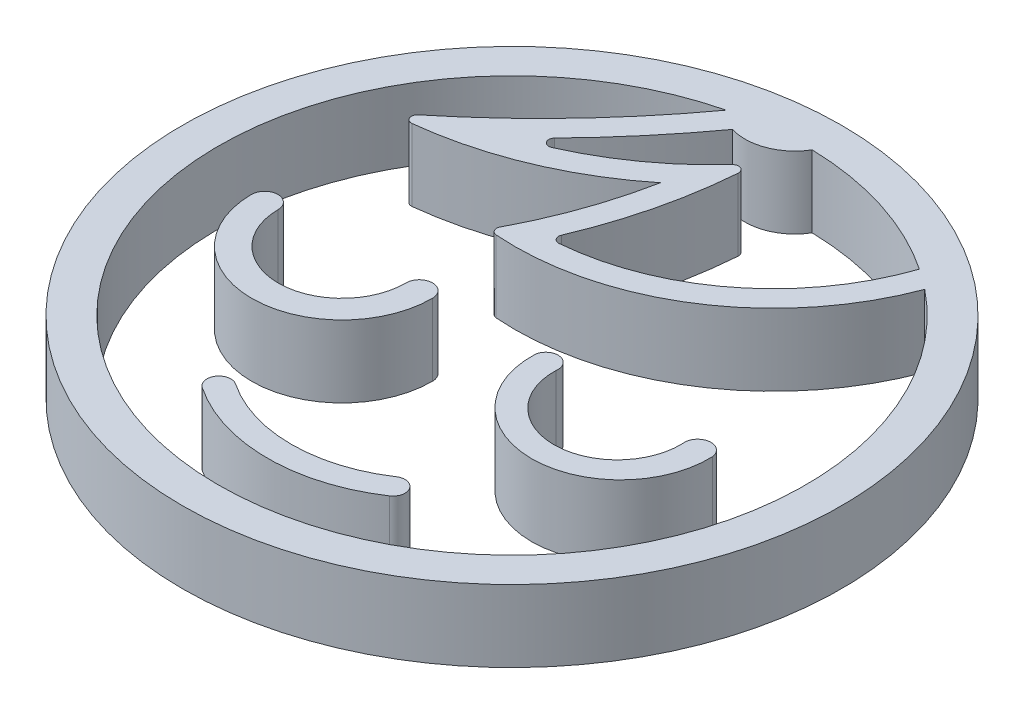
ISO-10303-21;
HEADER;
FILE_DESCRIPTION(('STEP AP214'),'2;1');
FILE_NAME('part.step','',(''),(''),'','','');
FILE_SCHEMA(('AUTOMOTIVE_DESIGN { 1 0 10303 214 1 1 1 1 }'));
ENDSEC;
DATA;
#1=APPLICATION_CONTEXT('core data for automotive mechanical design processes');
#2=APPLICATION_PROTOCOL_DEFINITION('international standard','automotive_design',2000,#1);
#3=PRODUCT_CONTEXT('',#1,'mechanical');
#4=PRODUCT('Part','Part','',(#3));
#5=PRODUCT_RELATED_PRODUCT_CATEGORY('part','',(#4));
#6=PRODUCT_DEFINITION_FORMATION('','',#4);
#7=PRODUCT_DEFINITION_CONTEXT('part definition',#1,'design');
#8=PRODUCT_DEFINITION('design','',#6,#7);
#9=PRODUCT_DEFINITION_SHAPE('','',#8);
#10=(LENGTH_UNIT() NAMED_UNIT(*) SI_UNIT(.MILLI.,.METRE.));
#11=(NAMED_UNIT(*) PLANE_ANGLE_UNIT() SI_UNIT($,.RADIAN.));
#12=(NAMED_UNIT(*) SI_UNIT($,.STERADIAN.) SOLID_ANGLE_UNIT());
#13=UNCERTAINTY_MEASURE_WITH_UNIT(LENGTH_MEASURE(1.E-05),#10,'distance_accuracy_value','');
#14=(GEOMETRIC_REPRESENTATION_CONTEXT(3) GLOBAL_UNCERTAINTY_ASSIGNED_CONTEXT((#13)) GLOBAL_UNIT_ASSIGNED_CONTEXT((#10,
#11,#12)) REPRESENTATION_CONTEXT('',''));
#15=CARTESIAN_POINT('',(0.,0.,0.));
#16=DIRECTION('',(0.,0.,1.));
#17=DIRECTION('',(1.,0.,0.));
#18=AXIS2_PLACEMENT_3D('',#15,#16,#17);
#19=CARTESIAN_POINT('',(-7.14874364678689,6.,17.3094622205207));
#20=DIRECTION('',(0.,-1.,0.));
#21=DIRECTION('',(0.,0.,-1.));
#22=AXIS2_PLACEMENT_3D('',#19,#20,#21);
#23=CYLINDRICAL_SURFACE('',#22,1.);
#24=CARTESIAN_POINT('',(-7.14874364678689,0.,17.3094622205207));
#25=DIRECTION('',(0.,1.,0.));
#26=DIRECTION('',(0.,0.,1.));
#27=AXIS2_PLACEMENT_3D('',#24,#25,#26);
#28=CIRCLE('',#27,1.);
#29=CARTESIAN_POINT('',(-6.59179802216933,0.,16.4789132627709));
#30=VERTEX_POINT('',#29);
#31=CARTESIAN_POINT('',(-7.70568927140446,0.,18.1400111782706));
#32=VERTEX_POINT('',#31);
#33=EDGE_CURVE('E13',#30,#32,#28,.T.);
#34=ORIENTED_EDGE('',*,*,#33,.T.);
#35=DIRECTION('',(0.,-1.,0.));
#36=VECTOR('',#35,1.);
#37=CARTESIAN_POINT('',(-7.70568927140446,6.,18.1400111782706));
#38=LINE('',#37,#36);
#39=CARTESIAN_POINT('',(-7.70568927140446,6.,18.1400111782706));
#40=VERTEX_POINT('',#39);
#41=EDGE_CURVE('E163',#40,#32,#38,.T.);
#42=ORIENTED_EDGE('',*,*,#41,.F.);
#43=CARTESIAN_POINT('',(-7.14874364678689,6.,17.3094622205207));
#44=DIRECTION('',(0.,1.,0.));
#45=DIRECTION('',(0.,0.,1.));
#46=AXIS2_PLACEMENT_3D('',#43,#44,#45);
#47=CIRCLE('',#46,1.);
#48=CARTESIAN_POINT('',(-6.59179802216933,6.,16.4789132627709));
#49=VERTEX_POINT('',#48);
#50=EDGE_CURVE('E96',#49,#40,#47,.T.);
#51=ORIENTED_EDGE('',*,*,#50,.F.);
#52=DIRECTION('',(0.,-1.,0.));
#53=VECTOR('',#52,1.);
#54=CARTESIAN_POINT('',(-6.59179802216933,6.,16.4789132627709));
#55=LINE('',#54,#53);
#56=EDGE_CURVE('E136',#49,#30,#55,.T.);
#57=ORIENTED_EDGE('',*,*,#56,.T.);
#58=EDGE_LOOP('',(#34,#42,#51,#57));
#59=FACE_BOUND('',#58,.T.);
#60=ADVANCED_FACE('F92',(#59),#23,.T.);
#61=CARTESIAN_POINT('',(0.114097404401391,6.,6.4787010137884));
#62=DIRECTION('',(0.,-1.,0.));
#63=DIRECTION('',(0.,0.,-1.));
#64=AXIS2_PLACEMENT_3D('',#61,#62,#63);
#65=CYLINDRICAL_SURFACE('',#64,14.0404849776411);
#66=CARTESIAN_POINT('',(0.114097404401391,0.,6.4787010137884));
#67=DIRECTION('',(0.,1.,0.));
#68=DIRECTION('',(0.,0.,1.));
#69=AXIS2_PLACEMENT_3D('',#66,#67,#68);
#70=CIRCLE('',#69,14.0404849776411);
#71=CARTESIAN_POINT('',(7.93388408020724,0.,18.1400111782706));
#72=VERTEX_POINT('',#71);
#73=EDGE_CURVE('E102',#32,#72,#70,.T.);
#74=ORIENTED_EDGE('',*,*,#73,.T.);
#75=DIRECTION('',(0.,-1.,0.));
#76=VECTOR('',#75,1.);
#77=CARTESIAN_POINT('',(7.93388408020724,6.,18.1400111782706));
#78=LINE('',#77,#76);
#79=CARTESIAN_POINT('',(7.93388408020724,6.,18.1400111782706));
#80=VERTEX_POINT('',#79);
#81=EDGE_CURVE('E150',#80,#72,#78,.T.);
#82=ORIENTED_EDGE('',*,*,#81,.F.);
#83=CARTESIAN_POINT('',(0.114097404401391,6.,6.4787010137884));
#84=DIRECTION('',(0.,1.,0.));
#85=DIRECTION('',(0.,0.,1.));
#86=AXIS2_PLACEMENT_3D('',#83,#84,#85);
#87=CIRCLE('',#86,14.0404849776411);
#88=EDGE_CURVE('E128',#40,#80,#87,.T.);
#89=ORIENTED_EDGE('',*,*,#88,.F.);
#90=ORIENTED_EDGE('',*,*,#41,.T.);
#91=EDGE_LOOP('',(#74,#82,#89,#90));
#92=FACE_BOUND('',#91,.T.);
#93=ADVANCED_FACE('F166',(#92),#65,.T.);
#94=CARTESIAN_POINT('',(7.37693845558968,6.,17.3094622205207));
#95=DIRECTION('',(0.,-1.,0.));
#96=DIRECTION('',(0.,0.,-1.));
#97=AXIS2_PLACEMENT_3D('',#94,#95,#96);
#98=CYLINDRICAL_SURFACE('',#97,1.);
#99=CARTESIAN_POINT('',(7.37693845558968,0.,17.3094622205207));
#100=DIRECTION('',(0.,-1.,0.));
#101=DIRECTION('',(0.,0.,-1.));
#102=AXIS2_PLACEMENT_3D('',#99,#100,#101);
#103=CIRCLE('',#102,1.);
#104=CARTESIAN_POINT('',(6.81999283097211,0.,16.4789132627709));
#105=VERTEX_POINT('',#104);
#106=EDGE_CURVE('E152',#105,#72,#103,.T.);
#107=ORIENTED_EDGE('',*,*,#106,.F.);
#108=DIRECTION('',(0.,-1.,0.));
#109=VECTOR('',#108,1.);
#110=CARTESIAN_POINT('',(6.81999283097211,6.,16.4789132627709));
#111=LINE('',#110,#109);
#112=CARTESIAN_POINT('',(6.81999283097211,6.,16.4789132627709));
#113=VERTEX_POINT('',#112);
#114=EDGE_CURVE('E141',#113,#105,#111,.T.);
#115=ORIENTED_EDGE('',*,*,#114,.F.);
#116=CARTESIAN_POINT('',(7.37693845558968,6.,17.3094622205207));
#117=DIRECTION('',(0.,-1.,0.));
#118=DIRECTION('',(0.,0.,-1.));
#119=AXIS2_PLACEMENT_3D('',#116,#117,#118);
#120=CIRCLE('',#119,1.);
#121=EDGE_CURVE('E161',#113,#80,#120,.T.);
#122=ORIENTED_EDGE('',*,*,#121,.T.);
#123=ORIENTED_EDGE('',*,*,#81,.T.);
#124=EDGE_LOOP('',(#107,#115,#122,#123));
#125=FACE_BOUND('',#124,.T.);
#126=ADVANCED_FACE('F153',(#125),#98,.T.);
#127=CARTESIAN_POINT('',(0.114097404401391,6.,6.4787010137884));
#128=DIRECTION('',(0.,-1.,0.));
#129=DIRECTION('',(0.,0.,-1.));
#130=AXIS2_PLACEMENT_3D('',#127,#128,#129);
#131=CYLINDRICAL_SURFACE('',#130,12.0404849776411);
#132=CARTESIAN_POINT('',(0.114097404401391,0.,6.4787010137884));
#133=DIRECTION('',(0.,1.,0.));
#134=DIRECTION('',(0.,0.,1.));
#135=AXIS2_PLACEMENT_3D('',#132,#133,#134);
#136=CIRCLE('',#135,12.0404849776411);
#137=EDGE_CURVE('E145',#30,#105,#136,.T.);
#138=ORIENTED_EDGE('',*,*,#137,.F.);
#139=ORIENTED_EDGE('',*,*,#56,.F.);
#140=CARTESIAN_POINT('',(0.114097404401391,6.,6.4787010137884));
#141=DIRECTION('',(0.,1.,0.));
#142=DIRECTION('',(0.,0.,1.));
#143=AXIS2_PLACEMENT_3D('',#140,#141,#142);
#144=CIRCLE('',#143,12.0404849776411);
#145=EDGE_CURVE('E147',#49,#113,#144,.T.);
#146=ORIENTED_EDGE('',*,*,#145,.T.);
#147=ORIENTED_EDGE('',*,*,#114,.T.);
#148=EDGE_LOOP('',(#138,#139,#146,#147));
#149=FACE_BOUND('',#148,.T.);
#150=ADVANCED_FACE('F143',(#149),#131,.F.);
#151=CARTESIAN_POINT('',(-3.51732312119275,6.,11.8940816171546));
#152=DIRECTION('',(0.,1.,0.));
#153=DIRECTION('',(0.,0.,1.));
#154=AXIS2_PLACEMENT_3D('',#151,#152,#153);
#155=PLANE('',#154);
#156=ORIENTED_EDGE('',*,*,#50,.T.);
#157=ORIENTED_EDGE('',*,*,#88,.T.);
#158=ORIENTED_EDGE('',*,*,#121,.F.);
#159=ORIENTED_EDGE('',*,*,#145,.F.);
#160=EDGE_LOOP('',(#156,#157,#158,#159));
#161=FACE_BOUND('',#160,.T.);
#162=ADVANCED_FACE('F94',(#161),#155,.T.);
#163=CARTESIAN_POINT('',(-3.51732312119275,0.,11.8940816171546));
#164=DIRECTION('',(0.,1.,0.));
#165=DIRECTION('',(0.,0.,1.));
#166=AXIS2_PLACEMENT_3D('',#163,#164,#165);
#167=PLANE('',#166);
#168=ORIENTED_EDGE('',*,*,#33,.F.);
#169=ORIENTED_EDGE('',*,*,#137,.T.);
#170=ORIENTED_EDGE('',*,*,#106,.T.);
#171=ORIENTED_EDGE('',*,*,#73,.F.);
#172=EDGE_LOOP('',(#168,#169,#170,#171));
#173=FACE_BOUND('',#172,.T.);
#174=ADVANCED_FACE('F155',(#173),#167,.F.);
#175=CLOSED_SHELL('',(#60,#93,#126,#150,#162,#174));
#176=MANIFOLD_SOLID_BREP('B2',#175);
#177=CARTESIAN_POINT('',(17.469349244798,6.,1.97457091893471));
#178=DIRECTION('',(0.,-1.,0.));
#179=DIRECTION('',(0.,0.,-1.));
#180=AXIS2_PLACEMENT_3D('',#177,#178,#179);
#181=CYLINDRICAL_SURFACE('',#180,1.10774963380561);
#182=CARTESIAN_POINT('',(17.469349244798,0.,1.97457091893471));
#183=DIRECTION('',(0.,1.,0.));
#184=DIRECTION('',(0.,0.,1.));
#185=AXIS2_PLACEMENT_3D('',#182,#183,#184);
#186=CIRCLE('',#185,1.10774963380561);
#187=CARTESIAN_POINT('',(18.5665540331402,0.,1.82208844900687));
#188=VERTEX_POINT('',#187);
#189=CARTESIAN_POINT('',(16.3721444564557,0.,2.12705338886256));
#190=VERTEX_POINT('',#189);
#191=EDGE_CURVE('E90',#188,#190,#186,.T.);
#192=ORIENTED_EDGE('',*,*,#191,.T.);
#193=DIRECTION('',(0.,-1.,0.));
#194=VECTOR('',#193,1.);
#195=CARTESIAN_POINT('',(16.3721444564557,6.,2.12705338886256));
#196=LINE('',#195,#194);
#197=CARTESIAN_POINT('',(16.3721444564557,6.,2.12705338886256));
#198=VERTEX_POINT('',#197);
#199=EDGE_CURVE('E300',#198,#190,#196,.T.);
#200=ORIENTED_EDGE('',*,*,#199,.F.);
#201=CARTESIAN_POINT('',(17.469349244798,6.,1.97457091893471));
#202=DIRECTION('',(0.,1.,0.));
#203=DIRECTION('',(0.,0.,1.));
#204=AXIS2_PLACEMENT_3D('',#201,#202,#203);
#205=CIRCLE('',#204,1.10774963380561);
#206=CARTESIAN_POINT('',(18.5665540331402,6.,1.82208844900687));
#207=VERTEX_POINT('',#206);
#208=EDGE_CURVE('E233',#207,#198,#205,.T.);
#209=ORIENTED_EDGE('',*,*,#208,.F.);
#210=DIRECTION('',(0.,-1.,0.));
#211=VECTOR('',#210,1.);
#212=CARTESIAN_POINT('',(18.5665540331402,6.,1.82208844900687));
#213=LINE('',#212,#211);
#214=EDGE_CURVE('E284',#207,#188,#213,.T.);
#215=ORIENTED_EDGE('',*,*,#214,.T.);
#216=EDGE_LOOP('',(#192,#200,#209,#215));
#217=FACE_BOUND('',#216,.T.);
#218=ADVANCED_FACE('F229',(#217),#181,.T.);
#219=CARTESIAN_POINT('',(11.0925166438843,6.,2.30745765026486));
#220=DIRECTION('',(0.,-1.,0.));
#221=DIRECTION('',(0.,0.,-1.));
#222=AXIS2_PLACEMENT_3D('',#219,#220,#221);
#223=CYLINDRICAL_SURFACE('',#222,5.282709109615);
#224=CARTESIAN_POINT('',(11.0925166438843,0.,2.30745765026486));
#225=DIRECTION('',(0.,-1.,0.));
#226=DIRECTION('',(0.,0.,-1.));
#227=AXIS2_PLACEMENT_3D('',#224,#225,#226);
#228=CIRCLE('',#227,5.282709109615);
#229=CARTESIAN_POINT('',(5.81288883131296,0.,2.12705338886256));
#230=VERTEX_POINT('',#229);
#231=EDGE_CURVE('E239',#190,#230,#228,.T.);
#232=ORIENTED_EDGE('',*,*,#231,.T.);
#233=DIRECTION('',(0.,-1.,0.));
#234=VECTOR('',#233,1.);
#235=CARTESIAN_POINT('',(5.81288883131296,6.,2.12705338886256));
#236=LINE('',#235,#234);
#237=CARTESIAN_POINT('',(5.81288883131296,6.,2.12705338886256));
#238=VERTEX_POINT('',#237);
#239=EDGE_CURVE('E285',#238,#230,#236,.T.);
#240=ORIENTED_EDGE('',*,*,#239,.F.);
#241=CARTESIAN_POINT('',(11.0925166438843,6.,2.30745765026486));
#242=DIRECTION('',(0.,-1.,0.));
#243=DIRECTION('',(0.,0.,-1.));
#244=AXIS2_PLACEMENT_3D('',#241,#242,#243);
#245=CIRCLE('',#244,5.282709109615);
#246=EDGE_CURVE('E265',#198,#238,#245,.T.);
#247=ORIENTED_EDGE('',*,*,#246,.F.);
#248=ORIENTED_EDGE('',*,*,#199,.T.);
#249=EDGE_LOOP('',(#232,#240,#247,#248));
#250=FACE_BOUND('',#249,.T.);
#251=ADVANCED_FACE('F303',(#250),#223,.F.);
#252=CARTESIAN_POINT('',(4.79251733603103,6.,1.97457091893471));
#253=DIRECTION('',(0.,-1.,0.));
#254=DIRECTION('',(0.,0.,-1.));
#255=AXIS2_PLACEMENT_3D('',#252,#253,#254);
#256=CYLINDRICAL_SURFACE('',#255,1.03170193952478);
#257=CARTESIAN_POINT('',(4.79251733603103,0.,1.97457091893471));
#258=DIRECTION('',(0.,-1.,0.));
#259=DIRECTION('',(0.,0.,-1.));
#260=AXIS2_PLACEMENT_3D('',#257,#258,#259);
#261=CIRCLE('',#260,1.03170193952478);
#262=CARTESIAN_POINT('',(3.77214584074909,0.,1.82208844900687));
#263=VERTEX_POINT('',#262);
#264=EDGE_CURVE('E288',#263,#230,#261,.T.);
#265=ORIENTED_EDGE('',*,*,#264,.F.);
#266=DIRECTION('',(0.,-1.,0.));
#267=VECTOR('',#266,1.);
#268=CARTESIAN_POINT('',(3.77214584074909,6.,1.82208844900687));
#269=LINE('',#268,#267);
#270=CARTESIAN_POINT('',(3.77214584074909,6.,1.82208844900687));
#271=VERTEX_POINT('',#270);
#272=EDGE_CURVE('E278',#271,#263,#269,.T.);
#273=ORIENTED_EDGE('',*,*,#272,.F.);
#274=CARTESIAN_POINT('',(4.79251733603103,6.,1.97457091893471));
#275=DIRECTION('',(0.,-1.,0.));
#276=DIRECTION('',(0.,0.,-1.));
#277=AXIS2_PLACEMENT_3D('',#274,#275,#276);
#278=CIRCLE('',#277,1.03170193952478);
#279=EDGE_CURVE('E296',#271,#238,#278,.T.);
#280=ORIENTED_EDGE('',*,*,#279,.T.);
#281=ORIENTED_EDGE('',*,*,#239,.T.);
#282=EDGE_LOOP('',(#265,#273,#280,#281));
#283=FACE_BOUND('',#282,.T.);
#284=ADVANCED_FACE('F290',(#283),#256,.T.);
#285=CARTESIAN_POINT('',(11.1693499369446,6.,2.12705338886256));
#286=DIRECTION('',(0.,-1.,0.));
#287=DIRECTION('',(0.,0.,-1.));
#288=AXIS2_PLACEMENT_3D('',#285,#286,#287);
#289=CYLINDRICAL_SURFACE('',#288,7.40348783042922);
#290=CARTESIAN_POINT('',(11.1693499369446,0.,2.12705338886256));
#291=DIRECTION('',(0.,1.,0.));
#292=DIRECTION('',(0.,0.,1.));
#293=AXIS2_PLACEMENT_3D('',#290,#291,#292);
#294=CIRCLE('',#293,7.40348783042922);
#295=EDGE_CURVE('E275',#263,#188,#294,.T.);
#296=ORIENTED_EDGE('',*,*,#295,.T.);
#297=ORIENTED_EDGE('',*,*,#214,.F.);
#298=CARTESIAN_POINT('',(11.1693499369446,6.,2.12705338886256));
#299=DIRECTION('',(0.,1.,0.));
#300=DIRECTION('',(0.,0.,1.));
#301=AXIS2_PLACEMENT_3D('',#298,#299,#300);
#302=CIRCLE('',#301,7.40348783042922);
#303=EDGE_CURVE('E280',#271,#207,#302,.T.);
#304=ORIENTED_EDGE('',*,*,#303,.F.);
#305=ORIENTED_EDGE('',*,*,#272,.T.);
#306=EDGE_LOOP('',(#296,#297,#304,#305));
#307=FACE_BOUND('',#306,.T.);
#308=ADVANCED_FACE('F279',(#307),#289,.T.);
#309=CARTESIAN_POINT('',(14.2809329443411,6.,2.14101428459979));
#310=DIRECTION('',(0.,1.,0.));
#311=DIRECTION('',(0.,0.,1.));
#312=AXIS2_PLACEMENT_3D('',#309,#310,#311);
#313=PLANE('',#312);
#314=ORIENTED_EDGE('',*,*,#208,.T.);
#315=ORIENTED_EDGE('',*,*,#246,.T.);
#316=ORIENTED_EDGE('',*,*,#279,.F.);
#317=ORIENTED_EDGE('',*,*,#303,.T.);
#318=EDGE_LOOP('',(#314,#315,#316,#317));
#319=FACE_BOUND('',#318,.T.);
#320=ADVANCED_FACE('F231',(#319),#313,.T.);
#321=CARTESIAN_POINT('',(14.2809329443411,0.,2.14101428459979));
#322=DIRECTION('',(0.,1.,0.));
#323=DIRECTION('',(0.,0.,1.));
#324=AXIS2_PLACEMENT_3D('',#321,#322,#323);
#325=PLANE('',#324);
#326=ORIENTED_EDGE('',*,*,#191,.F.);
#327=ORIENTED_EDGE('',*,*,#295,.F.);
#328=ORIENTED_EDGE('',*,*,#264,.T.);
#329=ORIENTED_EDGE('',*,*,#231,.F.);
#330=EDGE_LOOP('',(#326,#327,#328,#329));
#331=FACE_BOUND('',#330,.T.);
#332=ADVANCED_FACE('F287',(#331),#325,.F.);
#333=CLOSED_SHELL('',(#218,#251,#284,#308,#320,#332));
#334=MANIFOLD_SOLID_BREP('B7',#333);
#335=CARTESIAN_POINT('',(-5.66947989821205,6.,2.06515686335523));
#336=DIRECTION('',(0.,-1.,0.));
#337=DIRECTION('',(0.,0.,-1.));
#338=AXIS2_PLACEMENT_3D('',#335,#336,#337);
#339=CYLINDRICAL_SURFACE('',#338,1.10629898277813);
#340=CARTESIAN_POINT('',(-5.66947989821205,0.,2.06515686335523));
#341=DIRECTION('',(0.,1.,0.));
#342=DIRECTION('',(0.,0.,1.));
#343=AXIS2_PLACEMENT_3D('',#340,#341,#342);
#344=CIRCLE('',#343,1.10629898277813);
#345=CARTESIAN_POINT('',(-6.7757660309835,0.,2.07048900490641));
#346=VERTEX_POINT('',#345);
#347=CARTESIAN_POINT('',(-4.56319376544061,0.,2.05982472180405));
#348=VERTEX_POINT('',#347);
#349=EDGE_CURVE('E227',#346,#348,#344,.F.);
#350=ORIENTED_EDGE('',*,*,#349,.F.);
#351=DIRECTION('',(0.,-1.,0.));
#352=VECTOR('',#351,1.);
#353=CARTESIAN_POINT('',(-6.7757660309835,6.,2.07048900490641));
#354=LINE('',#353,#352);
#355=CARTESIAN_POINT('',(-6.7757660309835,6.,2.07048900490641));
#356=VERTEX_POINT('',#355);
#357=EDGE_CURVE('E384',#356,#346,#354,.T.);
#358=ORIENTED_EDGE('',*,*,#357,.F.);
#359=CARTESIAN_POINT('',(-5.66947989821205,6.,2.06515686335523));
#360=DIRECTION('',(0.,1.,0.));
#361=DIRECTION('',(0.,0.,1.));
#362=AXIS2_PLACEMENT_3D('',#359,#360,#361);
#363=CIRCLE('',#362,1.10629898277813);
#364=CARTESIAN_POINT('',(-4.56319376544061,6.,2.05982472180405));
#365=VERTEX_POINT('',#364);
#366=EDGE_CURVE('E369',#356,#365,#363,.F.);
#367=ORIENTED_EDGE('',*,*,#366,.T.);
#368=DIRECTION('',(0.,-1.,0.));
#369=VECTOR('',#368,1.);
#370=CARTESIAN_POINT('',(-4.56319376544061,6.,2.05982472180405));
#371=LINE('',#370,#369);
#372=EDGE_CURVE('E407',#365,#348,#371,.T.);
#373=ORIENTED_EDGE('',*,*,#372,.T.);
#374=EDGE_LOOP('',(#350,#358,#367,#373));
#375=FACE_BOUND('',#374,.T.);
#376=ADVANCED_FACE('F365',(#375),#339,.T.);
#377=CARTESIAN_POINT('',(-12.0904644655669,6.,2.09610509419429));
#378=DIRECTION('',(0.,-1.,0.));
#379=DIRECTION('',(0.,0.,-1.));
#380=AXIS2_PLACEMENT_3D('',#377,#378,#379);
#381=CYLINDRICAL_SURFACE('',#380,5.31476016717532);
#382=CARTESIAN_POINT('',(-12.0904644655669,0.,2.09610509419429));
#383=DIRECTION('',(0.,1.,0.));
#384=DIRECTION('',(0.,0.,1.));
#385=AXIS2_PLACEMENT_3D('',#382,#383,#384);
#386=CIRCLE('',#385,5.31476016717532);
#387=CARTESIAN_POINT('',(-17.4051629001503,0.,2.12172118348217));
#388=VERTEX_POINT('',#387);
#389=EDGE_CURVE('E375',#388,#346,#386,.T.);
#390=ORIENTED_EDGE('',*,*,#389,.F.);
#391=DIRECTION('',(0.,-1.,0.));
#392=VECTOR('',#391,1.);
#393=CARTESIAN_POINT('',(-17.4051629001503,6.,2.12172118348217));
#394=LINE('',#393,#392);
#395=CARTESIAN_POINT('',(-17.4051629001503,6.,2.12172118348217));
#396=VERTEX_POINT('',#395);
#397=EDGE_CURVE('E398',#396,#388,#394,.T.);
#398=ORIENTED_EDGE('',*,*,#397,.F.);
#399=CARTESIAN_POINT('',(-12.0904644655669,6.,2.09610509419429));
#400=DIRECTION('',(0.,1.,0.));
#401=DIRECTION('',(0.,0.,1.));
#402=AXIS2_PLACEMENT_3D('',#399,#400,#401);
#403=CIRCLE('',#402,5.31476016717532);
#404=EDGE_CURVE('E435',#396,#356,#403,.T.);
#405=ORIENTED_EDGE('',*,*,#404,.T.);
#406=ORIENTED_EDGE('',*,*,#357,.T.);
#407=EDGE_LOOP('',(#390,#398,#405,#406));
#408=FACE_BOUND('',#407,.T.);
#409=ADVANCED_FACE('F446',(#408),#381,.F.);
#410=CARTESIAN_POINT('',(-18.5114622758991,6.,2.12705338886261));
#411=DIRECTION('',(0.,-1.,0.));
#412=DIRECTION('',(0.,0.,-1.));
#413=AXIS2_PLACEMENT_3D('',#410,#411,#412);
#414=CYLINDRICAL_SURFACE('',#413,1.10631222590931);
#415=CARTESIAN_POINT('',(-18.5114622758991,0.,2.12705338886261));
#416=DIRECTION('',(0.,1.,0.));
#417=DIRECTION('',(0.,0.,1.));
#418=AXIS2_PLACEMENT_3D('',#415,#416,#417);
#419=CIRCLE('',#418,1.10631222590931);
#420=CARTESIAN_POINT('',(-19.6177616516479,0.,2.13238559424305));
#421=VERTEX_POINT('',#420);
#422=EDGE_CURVE('E426',#421,#388,#419,.F.);
#423=ORIENTED_EDGE('',*,*,#422,.F.);
#424=DIRECTION('',(0.,-1.,0.));
#425=VECTOR('',#424,1.);
#426=CARTESIAN_POINT('',(-19.6177616516479,6.,2.13238559424305));
#427=LINE('',#426,#425);
#428=CARTESIAN_POINT('',(-19.6177616516479,6.,2.13238559424305));
#429=VERTEX_POINT('',#428);
#430=EDGE_CURVE('E412',#429,#421,#427,.T.);
#431=ORIENTED_EDGE('',*,*,#430,.F.);
#432=CARTESIAN_POINT('',(-18.5114622758991,6.,2.12705338886261));
#433=DIRECTION('',(0.,1.,0.));
#434=DIRECTION('',(0.,0.,1.));
#435=AXIS2_PLACEMENT_3D('',#432,#433,#434);
#436=CIRCLE('',#435,1.10631222590931);
#437=EDGE_CURVE('E434',#429,#396,#436,.F.);
#438=ORIENTED_EDGE('',*,*,#437,.T.);
#439=ORIENTED_EDGE('',*,*,#397,.T.);
#440=EDGE_LOOP('',(#423,#431,#438,#439));
#441=FACE_BOUND('',#440,.T.);
#442=ADVANCED_FACE('F428',(#441),#414,.T.);
#443=CARTESIAN_POINT('',(-12.0904777085442,6.,2.09610515802355));
#444=DIRECTION('',(0.,-1.,0.));
#445=DIRECTION('',(0.,0.,-1.));
#446=AXIS2_PLACEMENT_3D('',#443,#444,#445);
#447=CYLINDRICAL_SURFACE('',#446,7.52737137586275);
#448=CARTESIAN_POINT('',(-12.0904777085442,0.,2.09610515802355));
#449=DIRECTION('',(0.,1.,0.));
#450=DIRECTION('',(0.,0.,1.));
#451=AXIS2_PLACEMENT_3D('',#448,#449,#450);
#452=CIRCLE('',#451,7.52737137586275);
#453=EDGE_CURVE('E415',#421,#348,#452,.T.);
#454=ORIENTED_EDGE('',*,*,#453,.T.);
#455=ORIENTED_EDGE('',*,*,#372,.F.);
#456=CARTESIAN_POINT('',(-12.0904777085442,6.,2.09610515802355));
#457=DIRECTION('',(0.,1.,0.));
#458=DIRECTION('',(0.,0.,1.));
#459=AXIS2_PLACEMENT_3D('',#456,#457,#458);
#460=CIRCLE('',#459,7.52737137586275);
#461=EDGE_CURVE('E416',#429,#365,#460,.T.);
#462=ORIENTED_EDGE('',*,*,#461,.F.);
#463=ORIENTED_EDGE('',*,*,#430,.T.);
#464=EDGE_LOOP('',(#454,#455,#462,#463));
#465=FACE_BOUND('',#464,.T.);
#466=ADVANCED_FACE('F414',(#465),#447,.T.);
#467=CARTESIAN_POINT('',(0.,6.,0.));
#468=DIRECTION('',(0.,1.,0.));
#469=DIRECTION('',(0.,0.,1.));
#470=AXIS2_PLACEMENT_3D('',#467,#468,#469);
#471=PLANE('',#470);
#472=ORIENTED_EDGE('',*,*,#366,.F.);
#473=ORIENTED_EDGE('',*,*,#404,.F.);
#474=ORIENTED_EDGE('',*,*,#437,.F.);
#475=ORIENTED_EDGE('',*,*,#461,.T.);
#476=EDGE_LOOP('',(#472,#473,#474,#475));
#477=FACE_BOUND('',#476,.T.);
#478=ADVANCED_FACE('F367',(#477),#471,.T.);
#479=CARTESIAN_POINT('',(0.,0.,0.));
#480=DIRECTION('',(0.,1.,0.));
#481=DIRECTION('',(0.,0.,1.));
#482=AXIS2_PLACEMENT_3D('',#479,#480,#481);
#483=PLANE('',#482);
#484=ORIENTED_EDGE('',*,*,#349,.T.);
#485=ORIENTED_EDGE('',*,*,#453,.F.);
#486=ORIENTED_EDGE('',*,*,#422,.T.);
#487=ORIENTED_EDGE('',*,*,#389,.T.);
#488=EDGE_LOOP('',(#484,#485,#486,#487));
#489=FACE_BOUND('',#488,.T.);
#490=ADVANCED_FACE('F424',(#489),#483,.F.);
#491=CLOSED_SHELL('',(#376,#409,#442,#466,#478,#490));
#492=MANIFOLD_SOLID_BREP('B84',#491);
#493=CARTESIAN_POINT('',(-4.87295911187466,6.,-26.677951783124));
#494=DIRECTION('',(0.,-1.,0.));
#495=DIRECTION('',(0.,0.,-1.));
#496=AXIS2_PLACEMENT_3D('',#493,#494,#495);
#497=CYLINDRICAL_SURFACE('',#496,21.5763660615755);
#498=CARTESIAN_POINT('',(-4.87295911187466,0.,-26.677951783124));
#499=DIRECTION('',(0.,1.,0.));
#500=DIRECTION('',(0.,0.,1.));
#501=AXIS2_PLACEMENT_3D('',#498,#499,#500);
#502=CIRCLE('',#501,21.5763660615755);
#503=CARTESIAN_POINT('',(15.3323886362147,0.,-19.1093657327519));
#504=VERTEX_POINT('',#503);
#505=CARTESIAN_POINT('',(-6.48191072172066,0.,-5.1616591856461));
#506=VERTEX_POINT('',#505);
#507=EDGE_CURVE('E683',#504,#506,#502,.F.);
#508=ORIENTED_EDGE('',*,*,#507,.F.);
#509=DIRECTION('',(0.,-1.,0.));
#510=VECTOR('',#509,1.);
#511=CARTESIAN_POINT('',(15.3323886362147,6.,-19.1093657327519));
#512=LINE('',#511,#510);
#513=CARTESIAN_POINT('',(15.3323886362147,6.,-19.1093657327519));
#514=VERTEX_POINT('',#513);
#515=EDGE_CURVE('E363',#514,#504,#512,.T.);
#516=ORIENTED_EDGE('',*,*,#515,.F.);
#517=CARTESIAN_POINT('',(-4.87295911187466,6.,-26.677951783124));
#518=DIRECTION('',(0.,1.,0.));
#519=DIRECTION('',(0.,0.,1.));
#520=AXIS2_PLACEMENT_3D('',#517,#518,#519);
#521=CIRCLE('',#520,21.5763660615755);
#522=CARTESIAN_POINT('',(-6.48191072172066,6.,-5.1616591856461));
#523=VERTEX_POINT('',#522);
#524=EDGE_CURVE('E717',#514,#523,#521,.F.);
#525=ORIENTED_EDGE('',*,*,#524,.T.);
#526=DIRECTION('',(0.,-1.,0.));
#527=VECTOR('',#526,1.);
#528=CARTESIAN_POINT('',(-6.48191072172066,6.,-5.1616591856461));
#529=LINE('',#528,#527);
#530=EDGE_CURVE('E511',#523,#506,#529,.T.);
#531=ORIENTED_EDGE('',*,*,#530,.T.);
#532=EDGE_LOOP('',(#508,#516,#525,#531));
#533=FACE_BOUND('',#532,.T.);
#534=ADVANCED_FACE('F492',(#533),#497,.T.);
#535=CARTESIAN_POINT('',(0.,6.,0.));
#536=DIRECTION('',(0.,-1.,0.));
#537=DIRECTION('',(0.,0.,-1.));
#538=AXIS2_PLACEMENT_3D('',#535,#536,#537);
#539=CYLINDRICAL_SURFACE('',#538,24.5);
#540=CARTESIAN_POINT('',(0.,0.,0.));
#541=DIRECTION('',(0.,1.,0.));
#542=DIRECTION('',(0.,0.,1.));
#543=AXIS2_PLACEMENT_3D('',#540,#541,#542);
#544=CIRCLE('',#543,24.5);
#545=CARTESIAN_POINT('',(-5.90115933937184,0.,-23.7786946330396));
#546=VERTEX_POINT('',#545);
#547=EDGE_CURVE('E682',#546,#504,#544,.T.);
#548=ORIENTED_EDGE('',*,*,#547,.F.);
#549=DIRECTION('',(0.,-1.,0.));
#550=VECTOR('',#549,1.);
#551=CARTESIAN_POINT('',(-5.90115933937184,6.,-23.7786946330396));
#552=LINE('',#551,#550);
#553=CARTESIAN_POINT('',(-5.90115933937184,6.,-23.7786946330396));
#554=VERTEX_POINT('',#553);
#555=EDGE_CURVE('E502',#554,#546,#552,.T.);
#556=ORIENTED_EDGE('',*,*,#555,.F.);
#557=CARTESIAN_POINT('',(0.,6.,0.));
#558=DIRECTION('',(0.,1.,0.));
#559=DIRECTION('',(0.,0.,1.));
#560=AXIS2_PLACEMENT_3D('',#557,#558,#559);
#561=CIRCLE('',#560,24.5);
#562=EDGE_CURVE('E716',#554,#514,#561,.T.);
#563=ORIENTED_EDGE('',*,*,#562,.T.);
#564=ORIENTED_EDGE('',*,*,#515,.T.);
#565=EDGE_LOOP('',(#548,#556,#563,#564));
#566=FACE_BOUND('',#565,.T.);
#567=ADVANCED_FACE('F745',(#566),#539,.F.);
#568=CARTESIAN_POINT('',(-62.7406578042502,6.,-65.1505884444028));
#569=DIRECTION('',(0.,-1.,0.));
#570=DIRECTION('',(0.,0.,-1.));
#571=AXIS2_PLACEMENT_3D('',#568,#569,#570);
#572=CYLINDRICAL_SURFACE('',#571,70.3019358430308);
#573=CARTESIAN_POINT('',(-62.7406578042502,0.,-65.1505884444028));
#574=DIRECTION('',(0.,1.,0.));
#575=DIRECTION('',(0.,0.,1.));
#576=AXIS2_PLACEMENT_3D('',#573,#574,#575);
#577=CIRCLE('',#576,70.3019358430308);
#578=CARTESIAN_POINT('',(-18.406444404923,0.,-10.5901659245896));
#579=VERTEX_POINT('',#578);
#580=EDGE_CURVE('E679',#579,#546,#577,.T.);
#581=ORIENTED_EDGE('',*,*,#580,.F.);
#582=DIRECTION('',(0.,-1.,0.));
#583=VECTOR('',#582,1.);
#584=CARTESIAN_POINT('',(-18.406444404923,6.,-10.5901659245896));
#585=LINE('',#584,#583);
#586=CARTESIAN_POINT('',(-18.406444404923,6.,-10.5901659245896));
#587=VERTEX_POINT('',#586);
#588=EDGE_CURVE('E637',#587,#579,#585,.T.);
#589=ORIENTED_EDGE('',*,*,#588,.F.);
#590=CARTESIAN_POINT('',(-62.7406578042502,6.,-65.1505884444028));
#591=DIRECTION('',(0.,1.,0.));
#592=DIRECTION('',(0.,0.,1.));
#593=AXIS2_PLACEMENT_3D('',#590,#591,#592);
#594=CIRCLE('',#593,70.3019358430308);
#595=EDGE_CURVE('E713',#587,#554,#594,.T.);
#596=ORIENTED_EDGE('',*,*,#595,.T.);
#597=ORIENTED_EDGE('',*,*,#555,.T.);
#598=EDGE_LOOP('',(#581,#589,#596,#597));
#599=FACE_BOUND('',#598,.T.);
#600=ADVANCED_FACE('F748',(#599),#572,.F.);
#601=CARTESIAN_POINT('',(-18.0911315129827,6.,-10.2021223958763));
#602=DIRECTION('',(0.,-1.,0.));
#603=DIRECTION('',(0.,0.,-1.));
#604=AXIS2_PLACEMENT_3D('',#601,#602,#603);
#605=CYLINDRICAL_SURFACE('',#604,0.499999999999997);
#606=CARTESIAN_POINT('',(-18.0911315129827,0.,-10.2021223958763));
#607=DIRECTION('',(0.,1.,0.));
#608=DIRECTION('',(0.,0.,1.));
#609=AXIS2_PLACEMENT_3D('',#606,#607,#608);
#610=CIRCLE('',#609,0.499999999999997);
#611=CARTESIAN_POINT('',(-18.0354854015477,0.,-9.70522853368624));
#612=VERTEX_POINT('',#611);
#613=EDGE_CURVE('E676',#612,#579,#610,.F.);
#614=ORIENTED_EDGE('',*,*,#613,.F.);
#615=DIRECTION('',(0.,-1.,0.));
#616=VECTOR('',#615,1.);
#617=CARTESIAN_POINT('',(-18.0354854015477,6.,-9.70522853368624));
#618=LINE('',#617,#616);
#619=CARTESIAN_POINT('',(-18.0354854015477,6.,-9.70522853368624));
#620=VERTEX_POINT('',#619);
#621=EDGE_CURVE('E635',#620,#612,#618,.T.);
#622=ORIENTED_EDGE('',*,*,#621,.F.);
#623=CARTESIAN_POINT('',(-18.0911315129827,6.,-10.2021223958763));
#624=DIRECTION('',(0.,1.,0.));
#625=DIRECTION('',(0.,0.,1.));
#626=AXIS2_PLACEMENT_3D('',#623,#624,#625);
#627=CIRCLE('',#626,0.499999999999997);
#628=EDGE_CURVE('E629',#620,#587,#627,.F.);
#629=ORIENTED_EDGE('',*,*,#628,.T.);
#630=ORIENTED_EDGE('',*,*,#588,.T.);
#631=EDGE_LOOP('',(#614,#622,#629,#630));
#632=FACE_BOUND('',#631,.T.);
#633=ADVANCED_FACE('F751',(#632),#605,.T.);
#634=CARTESIAN_POINT('',(-21.2019286012518,6.,-37.9800917780625));
#635=DIRECTION('',(0.,-1.,0.));
#636=DIRECTION('',(0.,0.,-1.));
#637=AXIS2_PLACEMENT_3D('',#634,#635,#636);
#638=CYLINDRICAL_SURFACE('',#637,28.451612503075);
#639=CARTESIAN_POINT('',(-21.2019286012518,0.,-37.9800917780625));
#640=DIRECTION('',(0.,1.,0.));
#641=DIRECTION('',(0.,0.,1.));
#642=AXIS2_PLACEMENT_3D('',#639,#640,#641);
#643=CIRCLE('',#642,28.451612503075);
#644=CARTESIAN_POINT('',(-3.39819664193381,0.,-15.7872690115488));
#645=VERTEX_POINT('',#644);
#646=EDGE_CURVE('E634',#612,#645,#643,.T.);
#647=ORIENTED_EDGE('',*,*,#646,.T.);
#648=DIRECTION('',(0.,-1.,0.));
#649=VECTOR('',#648,1.);
#650=CARTESIAN_POINT('',(-3.39819664193381,6.,-15.7872690115488));
#651=LINE('',#650,#649);
#652=CARTESIAN_POINT('',(-3.39819664193381,6.,-15.7872690115488));
#653=VERTEX_POINT('',#652);
#654=EDGE_CURVE('E616',#653,#645,#651,.T.);
#655=ORIENTED_EDGE('',*,*,#654,.F.);
#656=CARTESIAN_POINT('',(-21.2019286012518,6.,-37.9800917780625));
#657=DIRECTION('',(0.,1.,0.));
#658=DIRECTION('',(0.,0.,1.));
#659=AXIS2_PLACEMENT_3D('',#656,#657,#658);
#660=CIRCLE('',#659,28.451612503075);
#661=EDGE_CURVE('E621',#620,#653,#660,.T.);
#662=ORIENTED_EDGE('',*,*,#661,.F.);
#663=ORIENTED_EDGE('',*,*,#621,.T.);
#664=EDGE_LOOP('',(#647,#655,#662,#663));
#665=FACE_BOUND('',#664,.T.);
#666=ADVANCED_FACE('F632',(#665),#638,.T.);
#667=CARTESIAN_POINT('',(-38.6300343833516,6.,-22.6485999909825));
#668=DIRECTION('',(0.,-1.,0.));
#669=DIRECTION('',(0.,0.,-1.));
#670=AXIS2_PLACEMENT_3D('',#667,#668,#669);
#671=CYLINDRICAL_SURFACE('',#670,35.8937355738704);
#672=CARTESIAN_POINT('',(-38.6300343833516,0.,-22.6485999909825));
#673=DIRECTION('',(0.,1.,0.));
#674=DIRECTION('',(0.,0.,1.));
#675=AXIS2_PLACEMENT_3D('',#672,#673,#674);
#676=CIRCLE('',#675,35.8937355738704);
#677=CARTESIAN_POINT('',(-6.88680903760235,0.,-5.89366346183055));
#678=VERTEX_POINT('',#677);
#679=EDGE_CURVE('E673',#645,#678,#676,.F.);
#680=ORIENTED_EDGE('',*,*,#679,.T.);
#681=DIRECTION('',(0.,-1.,0.));
#682=VECTOR('',#681,1.);
#683=CARTESIAN_POINT('',(-6.88680903760235,6.,-5.89366346183055));
#684=LINE('',#683,#682);
#685=CARTESIAN_POINT('',(-6.88680903760235,6.,-5.89366346183055));
#686=VERTEX_POINT('',#685);
#687=EDGE_CURVE('E561',#686,#678,#684,.T.);
#688=ORIENTED_EDGE('',*,*,#687,.F.);
#689=CARTESIAN_POINT('',(-38.6300343833516,6.,-22.6485999909825));
#690=DIRECTION('',(0.,1.,0.));
#691=DIRECTION('',(0.,0.,1.));
#692=AXIS2_PLACEMENT_3D('',#689,#690,#691);
#693=CIRCLE('',#692,35.8937355738704);
#694=EDGE_CURVE('E612',#653,#686,#693,.F.);
#695=ORIENTED_EDGE('',*,*,#694,.F.);
#696=ORIENTED_EDGE('',*,*,#654,.T.);
#697=EDGE_LOOP('',(#680,#688,#695,#696));
#698=FACE_BOUND('',#697,.T.);
#699=ADVANCED_FACE('F614',(#698),#671,.F.);
#700=CARTESIAN_POINT('',(13.6506686539719,0.,-20.3447596520448));
#701=VERTEX_POINT('',#700);
#702=CARTESIAN_POINT('',(0.553855765121835,0.,-24.4937388691772));
#703=VERTEX_POINT('',#702);
#704=EDGE_CURVE('E708',#701,#703,#544,.T.);
#705=ORIENTED_EDGE('',*,*,#704,.F.);
#706=DIRECTION('',(0.,-1.,0.));
#707=VECTOR('',#706,1.);
#708=CARTESIAN_POINT('',(13.6506686539719,6.,-20.3447596520448));
#709=LINE('',#708,#707);
#710=CARTESIAN_POINT('',(13.6506686539719,6.,-20.3447596520448));
#711=VERTEX_POINT('',#710);
#712=EDGE_CURVE('E496',#711,#701,#709,.T.);
#713=ORIENTED_EDGE('',*,*,#712,.F.);
#714=CARTESIAN_POINT('',(0.553855765121835,6.,-24.4937388691772));
#715=VERTEX_POINT('',#714);
#716=EDGE_CURVE('E672',#711,#715,#561,.T.);
#717=ORIENTED_EDGE('',*,*,#716,.T.);
#718=DIRECTION('',(0.,-1.,0.));
#719=VECTOR('',#718,1.);
#720=CARTESIAN_POINT('',(0.553855765121835,6.,-24.4937388691772));
#721=LINE('',#720,#719);
#722=EDGE_CURVE('E644',#715,#703,#721,.T.);
#723=ORIENTED_EDGE('',*,*,#722,.T.);
#724=EDGE_LOOP('',(#705,#713,#717,#723));
#725=FACE_BOUND('',#724,.T.);
#726=ADVANCED_FACE('F776',(#725),#539,.F.);
#727=CARTESIAN_POINT('',(-4.87295911187466,6.,-26.677951783124));
#728=DIRECTION('',(0.,-1.,0.));
#729=DIRECTION('',(0.,0.,-1.));
#730=AXIS2_PLACEMENT_3D('',#727,#728,#729);
#731=CYLINDRICAL_SURFACE('',#730,19.5763660615755);
#732=CARTESIAN_POINT('',(-4.87295911187466,0.,-26.677951783124));
#733=DIRECTION('',(0.,1.,0.));
#734=DIRECTION('',(0.,0.,1.));
#735=AXIS2_PLACEMENT_3D('',#732,#733,#734);
#736=CIRCLE('',#735,19.5763660615755);
#737=CARTESIAN_POINT('',(-3.2376163219179,0.,-7.17001078115912));
#738=VERTEX_POINT('',#737);
#739=EDGE_CURVE('E706',#701,#738,#736,.F.);
#740=ORIENTED_EDGE('',*,*,#739,.T.);
#741=DIRECTION('',(0.,-1.,0.));
#742=VECTOR('',#741,1.);
#743=CARTESIAN_POINT('',(-3.2376163219179,6.,-7.17001078115912));
#744=LINE('',#743,#742);
#745=CARTESIAN_POINT('',(-3.2376163219179,6.,-7.17001078115912));
#746=VERTEX_POINT('',#745);
#747=EDGE_CURVE('E659',#746,#738,#744,.T.);
#748=ORIENTED_EDGE('',*,*,#747,.F.);
#749=CARTESIAN_POINT('',(-4.87295911187466,6.,-26.677951783124));
#750=DIRECTION('',(0.,1.,0.));
#751=DIRECTION('',(0.,0.,1.));
#752=AXIS2_PLACEMENT_3D('',#749,#750,#751);
#753=CIRCLE('',#752,19.5763660615755);
#754=EDGE_CURVE('E738',#711,#746,#753,.F.);
#755=ORIENTED_EDGE('',*,*,#754,.F.);
#756=ORIENTED_EDGE('',*,*,#712,.T.);
#757=EDGE_LOOP('',(#740,#748,#755,#756));
#758=FACE_BOUND('',#757,.T.);
#759=ADVANCED_FACE('F494',(#758),#731,.F.);
#760=CARTESIAN_POINT('',(-3.27938461499163,6.,-7.66826313659129));
#761=DIRECTION('',(0.,-1.,0.));
#762=DIRECTION('',(0.,0.,-1.));
#763=AXIS2_PLACEMENT_3D('',#760,#761,#762);
#764=CYLINDRICAL_SURFACE('',#763,0.500000000000004);
#765=CARTESIAN_POINT('',(-3.27938461499163,0.,-7.66826313659129));
#766=DIRECTION('',(0.,1.,0.));
#767=DIRECTION('',(0.,0.,1.));
#768=AXIS2_PLACEMENT_3D('',#765,#766,#767);
#769=CIRCLE('',#768,0.500000000000004);
#770=CARTESIAN_POINT('',(-3.73975463681908,0.,-7.86335143199263));
#771=VERTEX_POINT('',#770);
#772=EDGE_CURVE('E704',#738,#771,#769,.F.);
#773=ORIENTED_EDGE('',*,*,#772,.T.);
#774=DIRECTION('',(0.,-1.,0.));
#775=VECTOR('',#774,1.);
#776=CARTESIAN_POINT('',(-3.73975463681908,6.,-7.86335143199263));
#777=LINE('',#776,#775);
#778=CARTESIAN_POINT('',(-3.73975463681908,6.,-7.86335143199263));
#779=VERTEX_POINT('',#778);
#780=EDGE_CURVE('E658',#779,#771,#777,.T.);
#781=ORIENTED_EDGE('',*,*,#780,.F.);
#782=CARTESIAN_POINT('',(-3.27938461499163,6.,-7.66826313659129));
#783=DIRECTION('',(0.,1.,0.));
#784=DIRECTION('',(0.,0.,1.));
#785=AXIS2_PLACEMENT_3D('',#782,#783,#784);
#786=CIRCLE('',#785,0.500000000000004);
#787=EDGE_CURVE('E736',#746,#779,#786,.F.);
#788=ORIENTED_EDGE('',*,*,#787,.F.);
#789=ORIENTED_EDGE('',*,*,#747,.T.);
#790=EDGE_LOOP('',(#773,#781,#788,#789));
#791=FACE_BOUND('',#790,.T.);
#792=ADVANCED_FACE('F800',(#791),#764,.F.);
#793=CARTESIAN_POINT('',(-38.6300343833516,6.,-22.6485999909825));
#794=DIRECTION('',(0.,-1.,0.));
#795=DIRECTION('',(0.,0.,-1.));
#796=AXIS2_PLACEMENT_3D('',#793,#794,#795);
#797=CYLINDRICAL_SURFACE('',#796,37.8937355738704);
#798=CARTESIAN_POINT('',(-38.6300343833516,0.,-22.6485999909825));
#799=DIRECTION('',(0.,1.,0.));
#800=DIRECTION('',(0.,0.,1.));
#801=AXIS2_PLACEMENT_3D('',#798,#799,#800);
#802=CIRCLE('',#801,37.8937355738704);
#803=CARTESIAN_POINT('',(-0.850096282203137,0.,-19.7140688843488));
#804=VERTEX_POINT('',#803);
#805=EDGE_CURVE('E701',#804,#771,#802,.F.);
#806=ORIENTED_EDGE('',*,*,#805,.F.);
#807=DIRECTION('',(0.,-1.,0.));
#808=VECTOR('',#807,1.);
#809=CARTESIAN_POINT('',(-0.850096282203137,6.,-19.7140688843488));
#810=LINE('',#809,#808);
#811=CARTESIAN_POINT('',(-0.850096282203137,6.,-19.7140688843488));
#812=VERTEX_POINT('',#811);
#813=EDGE_CURVE('E656',#812,#804,#810,.T.);
#814=ORIENTED_EDGE('',*,*,#813,.F.);
#815=CARTESIAN_POINT('',(-38.6300343833516,6.,-22.6485999909825));
#816=DIRECTION('',(0.,1.,0.));
#817=DIRECTION('',(0.,0.,1.));
#818=AXIS2_PLACEMENT_3D('',#815,#816,#817);
#819=CIRCLE('',#818,37.8937355738704);
#820=EDGE_CURVE('E733',#812,#779,#819,.F.);
#821=ORIENTED_EDGE('',*,*,#820,.T.);
#822=ORIENTED_EDGE('',*,*,#780,.T.);
#823=EDGE_LOOP('',(#806,#814,#821,#822));
#824=FACE_BOUND('',#823,.T.);
#825=ADVANCED_FACE('F797',(#824),#797,.T.);
#826=CARTESIAN_POINT('',(-1.34859474809732,6.,-19.7527894150935));
#827=DIRECTION('',(0.,-1.,0.));
#828=DIRECTION('',(0.,0.,-1.));
#829=AXIS2_PLACEMENT_3D('',#826,#827,#828);
#830=CYLINDRICAL_SURFACE('',#829,0.500000000000001);
#831=CARTESIAN_POINT('',(-1.34859474809732,0.,-19.7527894150935));
#832=DIRECTION('',(0.,1.,0.));
#833=DIRECTION('',(0.,0.,1.));
#834=AXIS2_PLACEMENT_3D('',#831,#832,#833);
#835=CIRCLE('',#834,0.500000000000001);
#836=CARTESIAN_POINT('',(-1.71690914581451,0.,-20.0909380576077));
#837=VERTEX_POINT('',#836);
#838=EDGE_CURVE('E698',#804,#837,#835,.T.);
#839=ORIENTED_EDGE('',*,*,#838,.T.);
#840=DIRECTION('',(0.,-1.,0.));
#841=VECTOR('',#840,1.);
#842=CARTESIAN_POINT('',(-1.71690914581451,6.,-20.0909380576077));
#843=LINE('',#842,#841);
#844=CARTESIAN_POINT('',(-1.71690914581451,6.,-20.0909380576077));
#845=VERTEX_POINT('',#844);
#846=EDGE_CURVE('E654',#845,#837,#843,.T.);
#847=ORIENTED_EDGE('',*,*,#846,.F.);
#848=CARTESIAN_POINT('',(-1.34859474809732,6.,-19.7527894150935));
#849=DIRECTION('',(0.,1.,0.));
#850=DIRECTION('',(0.,0.,1.));
#851=AXIS2_PLACEMENT_3D('',#848,#849,#850);
#852=CIRCLE('',#851,0.500000000000001);
#853=EDGE_CURVE('E731',#812,#845,#852,.T.);
#854=ORIENTED_EDGE('',*,*,#853,.F.);
#855=ORIENTED_EDGE('',*,*,#813,.T.);
#856=EDGE_LOOP('',(#839,#847,#854,#855));
#857=FACE_BOUND('',#856,.T.);
#858=ADVANCED_FACE('F793',(#857),#830,.T.);
#859=CARTESIAN_POINT('',(-21.2019286012518,6.,-37.9800917780625));
#860=DIRECTION('',(0.,-1.,0.));
#861=DIRECTION('',(0.,0.,-1.));
#862=AXIS2_PLACEMENT_3D('',#859,#860,#861);
#863=CYLINDRICAL_SURFACE('',#862,26.451612503075);
#864=CARTESIAN_POINT('',(-21.2019286012518,0.,-37.9800917780625));
#865=DIRECTION('',(0.,1.,0.));
#866=DIRECTION('',(0.,0.,1.));
#867=AXIS2_PLACEMENT_3D('',#864,#865,#866);
#868=CIRCLE('',#867,26.451612503075);
#869=CARTESIAN_POINT('',(-10.4829182177526,0.,-13.79764731082));
#870=VERTEX_POINT('',#869);
#871=EDGE_CURVE('E695',#870,#837,#868,.T.);
#872=ORIENTED_EDGE('',*,*,#871,.F.);
#873=DIRECTION('',(0.,-1.,0.));
#874=VECTOR('',#873,1.);
#875=CARTESIAN_POINT('',(-10.4829182177526,6.,-13.79764731082));
#876=LINE('',#875,#874);
#877=CARTESIAN_POINT('',(-10.4829182177526,6.,-13.79764731082));
#878=VERTEX_POINT('',#877);
#879=EDGE_CURVE('E652',#878,#870,#876,.T.);
#880=ORIENTED_EDGE('',*,*,#879,.F.);
#881=CARTESIAN_POINT('',(-21.2019286012518,6.,-37.9800917780625));
#882=DIRECTION('',(0.,1.,0.));
#883=DIRECTION('',(0.,0.,1.));
#884=AXIS2_PLACEMENT_3D('',#881,#882,#883);
#885=CIRCLE('',#884,26.451612503075);
#886=EDGE_CURVE('E728',#878,#845,#885,.T.);
#887=ORIENTED_EDGE('',*,*,#886,.T.);
#888=ORIENTED_EDGE('',*,*,#846,.T.);
#889=EDGE_LOOP('',(#872,#880,#887,#888));
#890=FACE_BOUND('',#889,.T.);
#891=ADVANCED_FACE('F789',(#890),#863,.F.);
#892=CARTESIAN_POINT('',(-10.6855336609936,6.,-14.2547544997377));
#893=DIRECTION('',(0.,-1.,0.));
#894=DIRECTION('',(0.,0.,-1.));
#895=AXIS2_PLACEMENT_3D('',#892,#893,#894);
#896=CYLINDRICAL_SURFACE('',#895,0.500000000000007);
#897=CARTESIAN_POINT('',(-10.6855336609936,0.,-14.2547544997377));
#898=DIRECTION('',(0.,1.,0.));
#899=DIRECTION('',(0.,0.,1.));
#900=AXIS2_PLACEMENT_3D('',#897,#898,#899);
#901=CIRCLE('',#900,0.500000000000007);
#902=CARTESIAN_POINT('',(-11.0430456113317,0.,-14.6043045038365));
#903=VERTEX_POINT('',#902);
#904=EDGE_CURVE('E693',#870,#903,#901,.F.);
#905=ORIENTED_EDGE('',*,*,#904,.T.);
#906=DIRECTION('',(0.,-1.,0.));
#907=VECTOR('',#906,1.);
#908=CARTESIAN_POINT('',(-11.0430456113317,6.,-14.6043045038365));
#909=LINE('',#908,#907);
#910=CARTESIAN_POINT('',(-11.0430456113317,6.,-14.6043045038365));
#911=VERTEX_POINT('',#910);
#912=EDGE_CURVE('E649',#911,#903,#909,.T.);
#913=ORIENTED_EDGE('',*,*,#912,.F.);
#914=CARTESIAN_POINT('',(-10.6855336609936,6.,-14.2547544997377));
#915=DIRECTION('',(0.,1.,0.));
#916=DIRECTION('',(0.,0.,1.));
#917=AXIS2_PLACEMENT_3D('',#914,#915,#916);
#918=CIRCLE('',#917,0.500000000000007);
#919=EDGE_CURVE('E726',#878,#911,#918,.F.);
#920=ORIENTED_EDGE('',*,*,#919,.F.);
#921=ORIENTED_EDGE('',*,*,#879,.T.);
#922=EDGE_LOOP('',(#905,#913,#920,#921));
#923=FACE_BOUND('',#922,.T.);
#924=ADVANCED_FACE('F785',(#923),#896,.F.);
#925=CARTESIAN_POINT('',(-62.7406578042502,6.,-65.1505884444028));
#926=DIRECTION('',(0.,-1.,0.));
#927=DIRECTION('',(0.,0.,-1.));
#928=AXIS2_PLACEMENT_3D('',#925,#926,#927);
#929=CYLINDRICAL_SURFACE('',#928,72.3019358430308);
#930=CARTESIAN_POINT('',(-62.7406578042502,0.,-65.1505884444028));
#931=DIRECTION('',(0.,1.,0.));
#932=DIRECTION('',(0.,0.,1.));
#933=AXIS2_PLACEMENT_3D('',#930,#931,#932);
#934=CIRCLE('',#933,72.3019358430308);
#935=CARTESIAN_POINT('',(-4.2483949506567,0.,-22.6508812346364));
#936=VERTEX_POINT('',#935);
#937=EDGE_CURVE('E691',#903,#936,#934,.T.);
#938=ORIENTED_EDGE('',*,*,#937,.T.);
#939=DIRECTION('',(0.,-1.,0.));
#940=VECTOR('',#939,1.);
#941=CARTESIAN_POINT('',(-4.2483949506567,6.,-22.6508812346364));
#942=LINE('',#941,#940);
#943=CARTESIAN_POINT('',(-4.2483949506567,6.,-22.6508812346364));
#944=VERTEX_POINT('',#943);
#945=EDGE_CURVE('E646',#944,#936,#942,.T.);
#946=ORIENTED_EDGE('',*,*,#945,.F.);
#947=CARTESIAN_POINT('',(-62.7406578042502,6.,-65.1505884444028));
#948=DIRECTION('',(0.,1.,0.));
#949=DIRECTION('',(0.,0.,1.));
#950=AXIS2_PLACEMENT_3D('',#947,#948,#949);
#951=CIRCLE('',#950,72.3019358430308);
#952=EDGE_CURVE('E724',#911,#944,#951,.T.);
#953=ORIENTED_EDGE('',*,*,#952,.F.);
#954=ORIENTED_EDGE('',*,*,#912,.T.);
#955=EDGE_LOOP('',(#938,#946,#953,#954));
#956=FACE_BOUND('',#955,.T.);
#957=ADVANCED_FACE('F780',(#956),#929,.T.);
#958=CARTESIAN_POINT('',(0.,6.,0.));
#959=DIRECTION('',(0.,-1.,0.));
#960=DIRECTION('',(0.,0.,-1.));
#961=AXIS2_PLACEMENT_3D('',#958,#959,#960);
#962=CYLINDRICAL_SURFACE('',#961,27.5);
#963=CARTESIAN_POINT('',(0.,6.,0.));
#964=DIRECTION('',(0.,1.,0.));
#965=DIRECTION('',(0.,0.,1.));
#966=AXIS2_PLACEMENT_3D('',#963,#964,#965);
#967=CIRCLE('',#966,27.5);
#968=CARTESIAN_POINT('',(0.,6.,27.5));
#969=VERTEX_POINT('',#968);
#970=EDGE_CURVE('E719',#969,#969,#967,.T.);
#971=ORIENTED_EDGE('',*,*,#970,.F.);
#972=EDGE_LOOP('',(#971));
#973=FACE_BOUND('',#972,.T.);
#974=CARTESIAN_POINT('',(0.,0.,0.));
#975=DIRECTION('',(0.,1.,0.));
#976=DIRECTION('',(0.,0.,1.));
#977=AXIS2_PLACEMENT_3D('',#974,#975,#976);
#978=CIRCLE('',#977,27.5);
#979=CARTESIAN_POINT('',(0.,0.,27.5));
#980=VERTEX_POINT('',#979);
#981=EDGE_CURVE('E685',#980,#980,#978,.T.);
#982=ORIENTED_EDGE('',*,*,#981,.T.);
#983=EDGE_LOOP('',(#982));
#984=FACE_BOUND('',#983,.T.);
#985=ADVANCED_FACE('F765',(#973,#984),#962,.T.);
#986=CARTESIAN_POINT('',(-3.01946326751435,6.,-26.626896476857));
#987=DIRECTION('',(0.,-1.,0.));
#988=DIRECTION('',(0.,0.,-1.));
#989=AXIS2_PLACEMENT_3D('',#986,#987,#988);
#990=CYLINDRICAL_SURFACE('',#989,4.16160669552064);
#991=CARTESIAN_POINT('',(-3.01946326751435,0.,-26.626896476857));
#992=DIRECTION('',(0.,1.,0.));
#993=DIRECTION('',(0.,0.,1.));
#994=AXIS2_PLACEMENT_3D('',#991,#992,#993);
#995=CIRCLE('',#994,4.16160669552064);
#996=EDGE_CURVE('E688',#936,#703,#995,.T.);
#997=ORIENTED_EDGE('',*,*,#996,.T.);
#998=ORIENTED_EDGE('',*,*,#722,.F.);
#999=CARTESIAN_POINT('',(-3.01946326751435,6.,-26.626896476857));
#1000=DIRECTION('',(0.,1.,0.));
#1001=DIRECTION('',(0.,0.,1.));
#1002=AXIS2_PLACEMENT_3D('',#999,#1000,#1001);
#1003=CIRCLE('',#1002,4.16160669552064);
#1004=EDGE_CURVE('E722',#944,#715,#1003,.T.);
#1005=ORIENTED_EDGE('',*,*,#1004,.F.);
#1006=ORIENTED_EDGE('',*,*,#945,.T.);
#1007=EDGE_LOOP('',(#997,#998,#1005,#1006));
#1008=FACE_BOUND('',#1007,.T.);
#1009=ADVANCED_FACE('F757',(#1008),#990,.T.);
#1010=CARTESIAN_POINT('',(-6.44462567554435,6.,-5.66026707300011));
#1011=DIRECTION('',(0.,-1.,0.));
#1012=DIRECTION('',(0.,0.,-1.));
#1013=AXIS2_PLACEMENT_3D('',#1010,#1011,#1012);
#1014=CYLINDRICAL_SURFACE('',#1013,0.500000000000003);
#1015=CARTESIAN_POINT('',(-6.44462567554435,0.,-5.66026707300011));
#1016=DIRECTION('',(0.,1.,0.));
#1017=DIRECTION('',(0.,0.,1.));
#1018=AXIS2_PLACEMENT_3D('',#1015,#1016,#1017);
#1019=CIRCLE('',#1018,0.500000000000003);
#1020=EDGE_CURVE('E669',#506,#678,#1019,.F.);
#1021=ORIENTED_EDGE('',*,*,#1020,.F.);
#1022=ORIENTED_EDGE('',*,*,#530,.F.);
#1023=CARTESIAN_POINT('',(-6.44462567554435,6.,-5.66026707300011));
#1024=DIRECTION('',(0.,1.,0.));
#1025=DIRECTION('',(0.,0.,1.));
#1026=AXIS2_PLACEMENT_3D('',#1023,#1024,#1025);
#1027=CIRCLE('',#1026,0.500000000000003);
#1028=EDGE_CURVE('E620',#523,#686,#1027,.F.);
#1029=ORIENTED_EDGE('',*,*,#1028,.T.);
#1030=ORIENTED_EDGE('',*,*,#687,.T.);
#1031=EDGE_LOOP('',(#1021,#1022,#1029,#1030));
#1032=FACE_BOUND('',#1031,.T.);
#1033=ADVANCED_FACE('F755',(#1032),#1014,.T.);
#1034=CARTESIAN_POINT('',(0.,6.,0.));
#1035=DIRECTION('',(0.,1.,0.));
#1036=DIRECTION('',(0.,0.,1.));
#1037=AXIS2_PLACEMENT_3D('',#1034,#1035,#1036);
#1038=PLANE('',#1037);
#1039=ORIENTED_EDGE('',*,*,#716,.F.);
#1040=ORIENTED_EDGE('',*,*,#754,.T.);
#1041=ORIENTED_EDGE('',*,*,#787,.T.);
#1042=ORIENTED_EDGE('',*,*,#820,.F.);
#1043=ORIENTED_EDGE('',*,*,#853,.T.);
#1044=ORIENTED_EDGE('',*,*,#886,.F.);
#1045=ORIENTED_EDGE('',*,*,#919,.T.);
#1046=ORIENTED_EDGE('',*,*,#952,.T.);
#1047=ORIENTED_EDGE('',*,*,#1004,.T.);
#1048=EDGE_LOOP('',(#1039,#1040,#1041,#1042,#1043,#1044,#1045,#1046,#1047));
#1049=FACE_BOUND('',#1048,.T.);
#1050=ORIENTED_EDGE('',*,*,#970,.T.);
#1051=EDGE_LOOP('',(#1050));
#1052=FACE_BOUND('',#1051,.T.);
#1053=ORIENTED_EDGE('',*,*,#524,.F.);
#1054=ORIENTED_EDGE('',*,*,#562,.F.);
#1055=ORIENTED_EDGE('',*,*,#595,.F.);
#1056=ORIENTED_EDGE('',*,*,#628,.F.);
#1057=ORIENTED_EDGE('',*,*,#661,.T.);
#1058=ORIENTED_EDGE('',*,*,#694,.T.);
#1059=ORIENTED_EDGE('',*,*,#1028,.F.);
#1060=EDGE_LOOP('',(#1053,#1054,#1055,#1056,#1057,#1058,#1059));
#1061=FACE_BOUND('',#1060,.T.);
#1062=ADVANCED_FACE('F626',(#1049,#1052,#1061),#1038,.T.);
#1063=CARTESIAN_POINT('',(0.,0.,0.));
#1064=DIRECTION('',(0.,1.,0.));
#1065=DIRECTION('',(0.,0.,1.));
#1066=AXIS2_PLACEMENT_3D('',#1063,#1064,#1065);
#1067=PLANE('',#1066);
#1068=ORIENTED_EDGE('',*,*,#704,.T.);
#1069=ORIENTED_EDGE('',*,*,#996,.F.);
#1070=ORIENTED_EDGE('',*,*,#937,.F.);
#1071=ORIENTED_EDGE('',*,*,#904,.F.);
#1072=ORIENTED_EDGE('',*,*,#871,.T.);
#1073=ORIENTED_EDGE('',*,*,#838,.F.);
#1074=ORIENTED_EDGE('',*,*,#805,.T.);
#1075=ORIENTED_EDGE('',*,*,#772,.F.);
#1076=ORIENTED_EDGE('',*,*,#739,.F.);
#1077=EDGE_LOOP('',(#1068,#1069,#1070,#1071,#1072,#1073,#1074,#1075,#1076));
#1078=FACE_BOUND('',#1077,.T.);
#1079=ORIENTED_EDGE('',*,*,#981,.F.);
#1080=EDGE_LOOP('',(#1079));
#1081=FACE_BOUND('',#1080,.T.);
#1082=ORIENTED_EDGE('',*,*,#507,.T.);
#1083=ORIENTED_EDGE('',*,*,#1020,.T.);
#1084=ORIENTED_EDGE('',*,*,#679,.F.);
#1085=ORIENTED_EDGE('',*,*,#646,.F.);
#1086=ORIENTED_EDGE('',*,*,#613,.T.);
#1087=ORIENTED_EDGE('',*,*,#580,.T.);
#1088=ORIENTED_EDGE('',*,*,#547,.T.);
#1089=EDGE_LOOP('',(#1082,#1083,#1084,#1085,#1086,#1087,#1088));
#1090=FACE_BOUND('',#1089,.T.);
#1091=ADVANCED_FACE('F753',(#1078,#1081,#1090),#1067,.F.);
#1092=CLOSED_SHELL('',(#534,#567,#600,#633,#666,#699,#726,#759,#792,#825,#858,#891,#924,#957,
#985,#1009,#1033,#1062,#1091));
#1093=MANIFOLD_SOLID_BREP('B221',#1092);
#1094=ADVANCED_BREP_SHAPE_REPRESENTATION('',(#18,#176,#334,#492,#1093),#14);
#1095=SHAPE_DEFINITION_REPRESENTATION(#9,#1094);
ENDSEC;
END-ISO-10303-21;
